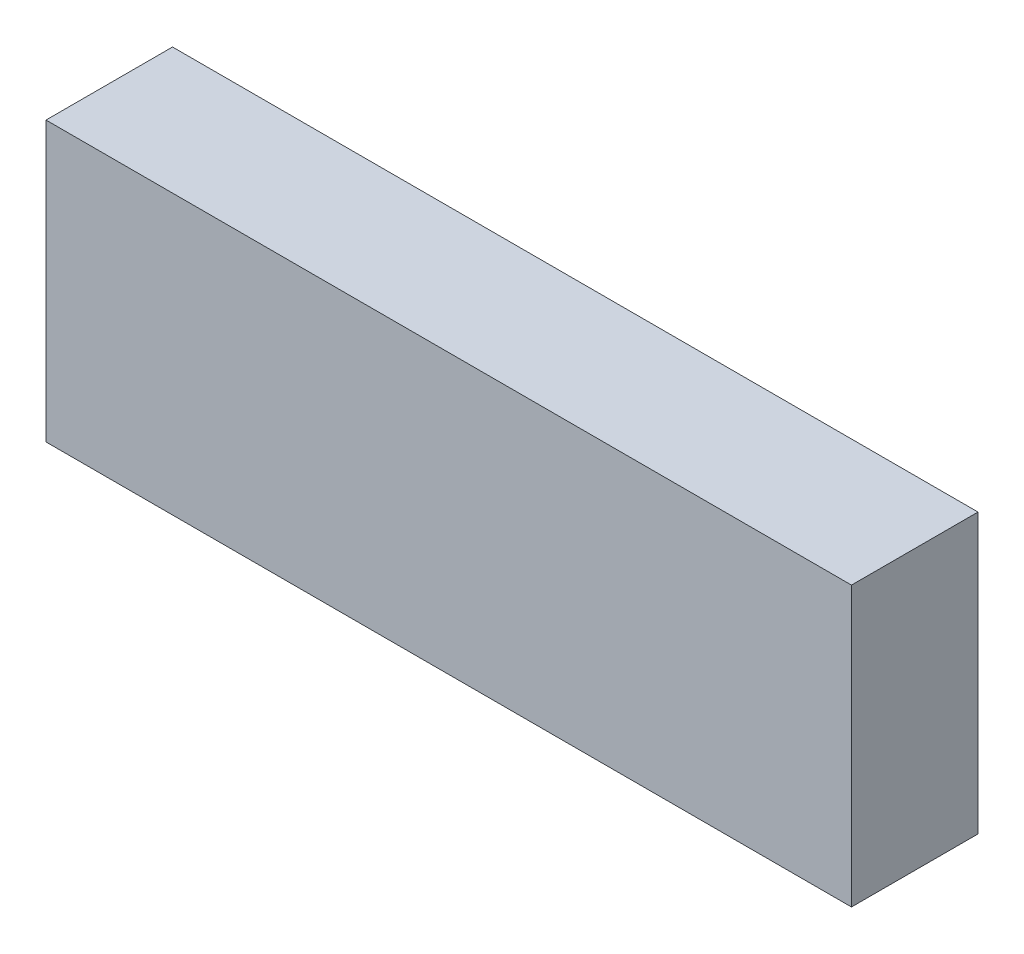
ISO-10303-21;
HEADER;
FILE_DESCRIPTION(('STEP AP214'),'2;1');
FILE_NAME('part.step','',(''),(''),'','','');
FILE_SCHEMA(('AUTOMOTIVE_DESIGN { 1 0 10303 214 1 1 1 1 }'));
ENDSEC;
DATA;
#1=APPLICATION_CONTEXT('core data for automotive mechanical design processes');
#2=APPLICATION_PROTOCOL_DEFINITION('international standard','automotive_design',2000,#1);
#3=PRODUCT_CONTEXT('',#1,'mechanical');
#4=PRODUCT('Part','Part','',(#3));
#5=PRODUCT_RELATED_PRODUCT_CATEGORY('part','',(#4));
#6=PRODUCT_DEFINITION_FORMATION('','',#4);
#7=PRODUCT_DEFINITION_CONTEXT('part definition',#1,'design');
#8=PRODUCT_DEFINITION('design','',#6,#7);
#9=PRODUCT_DEFINITION_SHAPE('','',#8);
#10=(LENGTH_UNIT() NAMED_UNIT(*) SI_UNIT(.MILLI.,.METRE.));
#11=(NAMED_UNIT(*) PLANE_ANGLE_UNIT() SI_UNIT($,.RADIAN.));
#12=(NAMED_UNIT(*) SI_UNIT($,.STERADIAN.) SOLID_ANGLE_UNIT());
#13=UNCERTAINTY_MEASURE_WITH_UNIT(LENGTH_MEASURE(1.E-05),#10,'distance_accuracy_value','');
#14=(GEOMETRIC_REPRESENTATION_CONTEXT(3) GLOBAL_UNCERTAINTY_ASSIGNED_CONTEXT((#13)) GLOBAL_UNIT_ASSIGNED_CONTEXT((#10,
#11,#12)) REPRESENTATION_CONTEXT('',''));
#15=CARTESIAN_POINT('',(0.,0.,0.));
#16=DIRECTION('',(0.,0.,1.));
#17=DIRECTION('',(1.,0.,0.));
#18=AXIS2_PLACEMENT_3D('',#15,#16,#17);
#19=CARTESIAN_POINT('',(164.381944227035,125.81394047579,-39.));
#20=DIRECTION('',(0.,0.,-1.));
#21=DIRECTION('',(-1.,0.,0.));
#22=AXIS2_PLACEMENT_3D('',#19,#20,#21);
#23=PLANE('',#22);
#24=DIRECTION('',(0.,1.,0.));
#25=VECTOR('',#24,1.);
#26=CARTESIAN_POINT('',(164.700257997072,125.81394047579,-39.));
#27=LINE('',#26,#25);
#28=CARTESIAN_POINT('',(164.700257997072,126.034295160808,-39.));
#29=VERTEX_POINT('',#28);
#30=CARTESIAN_POINT('',(164.700257997072,125.81394047579,-39.));
#31=VERTEX_POINT('',#30);
#32=EDGE_CURVE('E79',#29,#31,#27,.F.);
#33=ORIENTED_EDGE('',*,*,#32,.F.);
#34=DIRECTION('',(1.,0.,0.));
#35=VECTOR('',#34,1.);
#36=CARTESIAN_POINT('',(164.700257997072,126.034295160808,-39.));
#37=LINE('',#36,#35);
#38=CARTESIAN_POINT('',(164.063630456998,126.034295160808,-39.));
#39=VERTEX_POINT('',#38);
#40=EDGE_CURVE('E55',#39,#29,#37,.T.);
#41=ORIENTED_EDGE('',*,*,#40,.F.);
#42=DIRECTION('',(0.,1.,0.));
#43=VECTOR('',#42,1.);
#44=CARTESIAN_POINT('',(164.063630456998,126.034295160808,-39.));
#45=LINE('',#44,#43);
#46=CARTESIAN_POINT('',(164.063630456998,125.81394047579,-39.));
#47=VERTEX_POINT('',#46);
#48=EDGE_CURVE('E57',#47,#39,#45,.T.);
#49=ORIENTED_EDGE('',*,*,#48,.F.);
#50=DIRECTION('',(1.,0.,0.));
#51=VECTOR('',#50,1.);
#52=CARTESIAN_POINT('',(164.063630456998,125.81394047579,-39.));
#53=LINE('',#52,#51);
#54=EDGE_CURVE('E20',#31,#47,#53,.F.);
#55=ORIENTED_EDGE('',*,*,#54,.F.);
#56=EDGE_LOOP('',(#33,#41,#49,#55));
#57=FACE_BOUND('',#56,.T.);
#58=ADVANCED_FACE('F17',(#57),#23,.F.);
#59=CARTESIAN_POINT('',(164.063630456998,125.81394047579,-39.1));
#60=DIRECTION('',(0.,-1.,0.));
#61=DIRECTION('',(0.,0.,-1.));
#62=AXIS2_PLACEMENT_3D('',#59,#60,#61);
#63=PLANE('',#62);
#64=DIRECTION('',(-1.,0.,0.));
#65=VECTOR('',#64,1.);
#66=CARTESIAN_POINT('',(164.381944227035,125.81394047579,-39.1));
#67=LINE('',#66,#65);
#68=CARTESIAN_POINT('',(164.700257997072,125.81394047579,-39.1));
#69=VERTEX_POINT('',#68);
#70=CARTESIAN_POINT('',(164.063630456998,125.81394047579,-39.1));
#71=VERTEX_POINT('',#70);
#72=EDGE_CURVE('E83',#69,#71,#67,.T.);
#73=ORIENTED_EDGE('',*,*,#72,.F.);
#74=DIRECTION('',(0.,0.,-1.));
#75=VECTOR('',#74,1.);
#76=CARTESIAN_POINT('',(164.700257997072,125.81394047579,-39.1));
#77=LINE('',#76,#75);
#78=EDGE_CURVE('E68',#31,#69,#77,.T.);
#79=ORIENTED_EDGE('',*,*,#78,.F.);
#80=ORIENTED_EDGE('',*,*,#54,.T.);
#81=DIRECTION('',(0.,0.,1.));
#82=VECTOR('',#81,1.);
#83=CARTESIAN_POINT('',(164.063630456998,125.81394047579,-39.1));
#84=LINE('',#83,#82);
#85=EDGE_CURVE('E63',#71,#47,#84,.T.);
#86=ORIENTED_EDGE('',*,*,#85,.F.);
#87=EDGE_LOOP('',(#73,#79,#80,#86));
#88=FACE_BOUND('',#87,.T.);
#89=ADVANCED_FACE('F65',(#88),#63,.T.);
#90=CARTESIAN_POINT('',(164.063630456998,126.034295160808,-39.1));
#91=DIRECTION('',(-1.,0.,0.));
#92=DIRECTION('',(0.,0.,1.));
#93=AXIS2_PLACEMENT_3D('',#90,#91,#92);
#94=PLANE('',#93);
#95=DIRECTION('',(0.,1.,0.));
#96=VECTOR('',#95,1.);
#97=CARTESIAN_POINT('',(164.063630456998,125.81394047579,-39.1));
#98=LINE('',#97,#96);
#99=CARTESIAN_POINT('',(164.063630456998,126.034295160808,-39.1));
#100=VERTEX_POINT('',#99);
#101=EDGE_CURVE('E72',#71,#100,#98,.T.);
#102=ORIENTED_EDGE('',*,*,#101,.F.);
#103=ORIENTED_EDGE('',*,*,#85,.T.);
#104=ORIENTED_EDGE('',*,*,#48,.T.);
#105=DIRECTION('',(0.,0.,1.));
#106=VECTOR('',#105,1.);
#107=CARTESIAN_POINT('',(164.063630456998,126.034295160808,-39.1));
#108=LINE('',#107,#106);
#109=EDGE_CURVE('E75',#100,#39,#108,.T.);
#110=ORIENTED_EDGE('',*,*,#109,.F.);
#111=EDGE_LOOP('',(#102,#103,#104,#110));
#112=FACE_BOUND('',#111,.T.);
#113=ADVANCED_FACE('F70',(#112),#94,.T.);
#114=CARTESIAN_POINT('',(164.700257997072,126.034295160808,-39.1));
#115=DIRECTION('',(0.,1.,0.));
#116=DIRECTION('',(0.,0.,1.));
#117=AXIS2_PLACEMENT_3D('',#114,#115,#116);
#118=PLANE('',#117);
#119=DIRECTION('',(-1.,0.,0.));
#120=VECTOR('',#119,1.);
#121=CARTESIAN_POINT('',(164.381944227035,126.034295160808,-39.1));
#122=LINE('',#121,#120);
#123=CARTESIAN_POINT('',(164.700257997072,126.034295160808,-39.1));
#124=VERTEX_POINT('',#123);
#125=EDGE_CURVE('E26',#100,#124,#122,.F.);
#126=ORIENTED_EDGE('',*,*,#125,.F.);
#127=ORIENTED_EDGE('',*,*,#109,.T.);
#128=ORIENTED_EDGE('',*,*,#40,.T.);
#129=DIRECTION('',(0.,0.,-1.));
#130=VECTOR('',#129,1.);
#131=CARTESIAN_POINT('',(164.700257997072,126.034295160808,-39.1));
#132=LINE('',#131,#130);
#133=EDGE_CURVE('E35',#124,#29,#132,.F.);
#134=ORIENTED_EDGE('',*,*,#133,.F.);
#135=EDGE_LOOP('',(#126,#127,#128,#134));
#136=FACE_BOUND('',#135,.T.);
#137=ADVANCED_FACE('F89',(#136),#118,.T.);
#138=CARTESIAN_POINT('',(164.700257997072,125.81394047579,-39.1));
#139=DIRECTION('',(1.,0.,0.));
#140=DIRECTION('',(0.,0.,-1.));
#141=AXIS2_PLACEMENT_3D('',#138,#139,#140);
#142=PLANE('',#141);
#143=DIRECTION('',(0.,1.,0.));
#144=VECTOR('',#143,1.);
#145=CARTESIAN_POINT('',(164.700257997072,125.81394047579,-39.1));
#146=LINE('',#145,#144);
#147=EDGE_CURVE('E11',#124,#69,#146,.F.);
#148=ORIENTED_EDGE('',*,*,#147,.F.);
#149=ORIENTED_EDGE('',*,*,#133,.T.);
#150=ORIENTED_EDGE('',*,*,#32,.T.);
#151=ORIENTED_EDGE('',*,*,#78,.T.);
#152=EDGE_LOOP('',(#148,#149,#150,#151));
#153=FACE_BOUND('',#152,.T.);
#154=ADVANCED_FACE('F91',(#153),#142,.T.);
#155=CARTESIAN_POINT('',(164.381944227035,125.81394047579,-39.1));
#156=DIRECTION('',(0.,0.,-1.));
#157=DIRECTION('',(-1.,0.,0.));
#158=AXIS2_PLACEMENT_3D('',#155,#156,#157);
#159=PLANE('',#158);
#160=ORIENTED_EDGE('',*,*,#125,.T.);
#161=ORIENTED_EDGE('',*,*,#147,.T.);
#162=ORIENTED_EDGE('',*,*,#72,.T.);
#163=ORIENTED_EDGE('',*,*,#101,.T.);
#164=EDGE_LOOP('',(#160,#161,#162,#163));
#165=FACE_BOUND('',#164,.T.);
#166=ADVANCED_FACE('F88',(#165),#159,.T.);
#167=CLOSED_SHELL('',(#58,#89,#113,#137,#154,#166));
#168=MANIFOLD_SOLID_BREP('B1',#167);
#169=ADVANCED_BREP_SHAPE_REPRESENTATION('',(#18,#168),#14);
#170=SHAPE_DEFINITION_REPRESENTATION(#9,#169);
ENDSEC;
END-ISO-10303-21;
